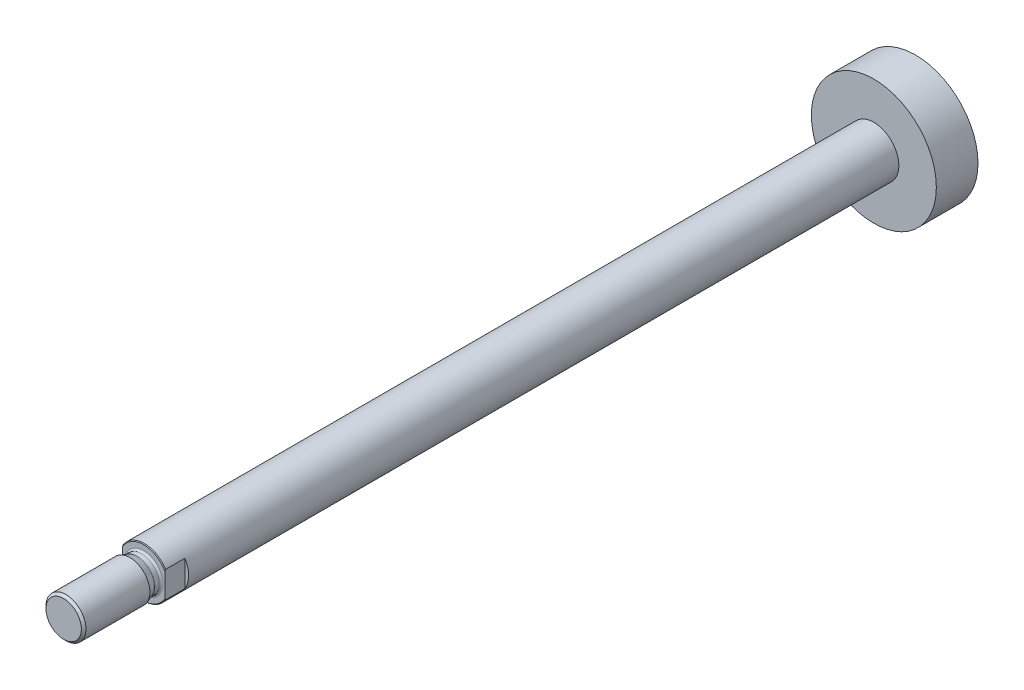
ISO-10303-21;
HEADER;
FILE_DESCRIPTION(('STEP AP214'),'2;1');
FILE_NAME('part.step','',(''),(''),'','','');
FILE_SCHEMA(('AUTOMOTIVE_DESIGN { 1 0 10303 214 1 1 1 1 }'));
ENDSEC;
DATA;
#1=APPLICATION_CONTEXT('core data for automotive mechanical design processes');
#2=APPLICATION_PROTOCOL_DEFINITION('international standard','automotive_design',2000,#1);
#3=PRODUCT_CONTEXT('',#1,'mechanical');
#4=PRODUCT('Part','Part','',(#3));
#5=PRODUCT_RELATED_PRODUCT_CATEGORY('part','',(#4));
#6=PRODUCT_DEFINITION_FORMATION('','',#4);
#7=PRODUCT_DEFINITION_CONTEXT('part definition',#1,'design');
#8=PRODUCT_DEFINITION('design','',#6,#7);
#9=PRODUCT_DEFINITION_SHAPE('','',#8);
#10=(LENGTH_UNIT() NAMED_UNIT(*) SI_UNIT(.MILLI.,.METRE.));
#11=(NAMED_UNIT(*) PLANE_ANGLE_UNIT() SI_UNIT($,.RADIAN.));
#12=(NAMED_UNIT(*) SI_UNIT($,.STERADIAN.) SOLID_ANGLE_UNIT());
#13=UNCERTAINTY_MEASURE_WITH_UNIT(LENGTH_MEASURE(1.E-05),#10,'distance_accuracy_value','');
#14=(GEOMETRIC_REPRESENTATION_CONTEXT(3) GLOBAL_UNCERTAINTY_ASSIGNED_CONTEXT((#13)) GLOBAL_UNIT_ASSIGNED_CONTEXT((#10,
#11,#12)) REPRESENTATION_CONTEXT('',''));
#15=CARTESIAN_POINT('',(0.,0.,0.));
#16=DIRECTION('',(0.,0.,1.));
#17=DIRECTION('',(1.,0.,0.));
#18=AXIS2_PLACEMENT_3D('',#15,#16,#17);
#19=CARTESIAN_POINT('',(0.,0.,35.517157287525));
#20=DIRECTION('',(0.,0.,-1.));
#21=DIRECTION('',(-1.,0.,0.));
#22=AXIS2_PLACEMENT_3D('',#19,#20,#21);
#23=CONICAL_SURFACE('',#22,10.,0.785398163396789);
#24=CARTESIAN_POINT('',(0.,0.,35.517157287525));
#25=DIRECTION('',(0.,0.,1.));
#26=DIRECTION('',(1.,0.,0.));
#27=AXIS2_PLACEMENT_3D('',#24,#25,#26);
#28=CIRCLE('',#27,10.);
#29=CARTESIAN_POINT('',(8.5,5.26782687642637,35.5171572875251));
#30=VERTEX_POINT('',#29);
#31=CARTESIAN_POINT('',(-8.5,5.26782687642637,35.517157287525));
#32=VERTEX_POINT('',#31);
#33=EDGE_CURVE('E111',#30,#32,#28,.T.);
#34=ORIENTED_EDGE('',*,*,#33,.T.);
#35=CARTESIAN_POINT('',(-8.5,5.26915557656065,35.516457287525));
#36=CARTESIAN_POINT('',(-8.5,5.12043060075285,35.5948084470723));
#37=CARTESIAN_POINT('',(-8.5,4.97072659120836,35.6712969898472));
#38=CARTESIAN_POINT('',(-8.5,4.66917700252257,35.8200459260869));
#39=CARTESIAN_POINT('',(-8.5,4.51733076749188,35.892304988137));
#40=CARTESIAN_POINT('',(-8.5,4.05732044553358,36.1024241503473));
#41=CARTESIAN_POINT('',(-8.5,3.74577535220427,36.233042707959));
#42=CARTESIAN_POINT('',(-8.5,3.11534351671797,36.4689248269962));
#43=CARTESIAN_POINT('',(-8.5,2.79651503376638,36.5743421856605));
#44=CARTESIAN_POINT('',(-8.5,2.1506721380425,36.7547567774749));
#45=CARTESIAN_POINT('',(-8.5,1.82367112190679,36.8298007197674));
#46=CARTESIAN_POINT('',(-8.5,1.24231953836921,36.9304202267378));
#47=CARTESIAN_POINT('',(-8.5,0.989271939120768,36.9635301629902));
#48=CARTESIAN_POINT('',(-8.5,0.481167069520872,37.0073090658038));
#49=CARTESIAN_POINT('',(-8.5,0.226109555666254,37.0179752699881));
#50=CARTESIAN_POINT('',(-8.5,-0.283937189922841,37.0162409520619));
#51=CARTESIAN_POINT('',(-8.5,-0.538926417990283,37.0038393722915));
#52=CARTESIAN_POINT('',(-8.5,-1.046754464396,36.9566828919383));
#53=CARTESIAN_POINT('',(-8.5,-1.29959352286743,36.9219305216357));
#54=CARTESIAN_POINT('',(-8.5,-1.87570958089529,36.8185336386205));
#55=CARTESIAN_POINT('',(-8.5,-2.19773337553153,36.7429103350757));
#56=CARTESIAN_POINT('',(-8.5,-2.83377743832144,36.5624420542977));
#57=CARTESIAN_POINT('',(-8.5,-3.14778540789577,36.457554811385));
#58=CARTESIAN_POINT('',(-8.5,-3.76859152936398,36.2236601146405));
#59=CARTESIAN_POINT('',(-8.5,-4.07533933724897,36.0945206165778));
#60=CARTESIAN_POINT('',(-8.5,-4.52839886908916,35.8870755616324));
#61=CARTESIAN_POINT('',(-8.5,-4.67798675824017,35.8157742380196));
#62=CARTESIAN_POINT('',(-8.5,-4.97508487478715,35.6690699624143));
#63=CARTESIAN_POINT('',(-8.5,-5.12259570663118,35.5936682360983));
#64=CARTESIAN_POINT('',(-8.5,-5.26915557656065,35.516457287525));
#65=B_SPLINE_CURVE_WITH_KNOTS('',3,(#35,#36,#37,#38,#39,#40,#41,#42,#43,#44,#45,#46,#47,#48,#49,
#50,#51,#52,#53,#54,#55,#56,#57,#58,#59,#60,#61,#62,#63,#64),.UNSPECIFIED.,.F.,.F.,(4,2,2,2,2,2,
2,2,2,2,2,2,2,2,4),(0.,0.504278327288993,1.00871455388979,2.02129192912044,3.02752230535171,
4.03219933682804,4.79690515443071,5.56170508659906,6.32654008577888,7.09128851504007,
8.08191982677642,9.07398937280026,10.0716257637772,10.5687120408264,11.0656505389054),.UNSPECIFIED.);
#66=CARTESIAN_POINT('',(-8.5,4.70883698491549,35.8));
#67=VERTEX_POINT('',#66);
#68=EDGE_CURVE('E123',#32,#67,#65,.T.);
#69=ORIENTED_EDGE('',*,*,#68,.T.);
#70=CARTESIAN_POINT('',(0.,0.,35.8));
#71=DIRECTION('',(0.,0.,1.));
#72=DIRECTION('',(1.,0.,0.));
#73=AXIS2_PLACEMENT_3D('',#70,#71,#72);
#74=CIRCLE('',#73,9.7171572875254);
#75=CARTESIAN_POINT('',(8.5,4.70883698491591,35.8));
#76=VERTEX_POINT('',#75);
#77=EDGE_CURVE('E97',#76,#67,#74,.T.);
#78=ORIENTED_EDGE('',*,*,#77,.F.);
#79=CARTESIAN_POINT('',(8.5,-5.26915557656065,35.516457287525));
#80=CARTESIAN_POINT('',(8.5,-5.12043060075285,35.5948084470723));
#81=CARTESIAN_POINT('',(8.5,-4.97072659120836,35.6712969898472));
#82=CARTESIAN_POINT('',(8.5,-4.66917700252257,35.8200459260869));
#83=CARTESIAN_POINT('',(8.5,-4.51733076749188,35.892304988137));
#84=CARTESIAN_POINT('',(8.5,-4.05732044553358,36.1024241503473));
#85=CARTESIAN_POINT('',(8.5,-3.74577535220427,36.233042707959));
#86=CARTESIAN_POINT('',(8.5,-3.11534351671797,36.4689248269962));
#87=CARTESIAN_POINT('',(8.5,-2.79651503376638,36.5743421856605));
#88=CARTESIAN_POINT('',(8.5,-2.1506721380425,36.7547567774749));
#89=CARTESIAN_POINT('',(8.5,-1.82367112190679,36.8298007197674));
#90=CARTESIAN_POINT('',(8.5,-1.24231953836921,36.9304202267378));
#91=CARTESIAN_POINT('',(8.5,-0.989271939120768,36.9635301629902));
#92=CARTESIAN_POINT('',(8.5,-0.481167069520872,37.0073090658038));
#93=CARTESIAN_POINT('',(8.5,-0.226109555666254,37.0179752699881));
#94=CARTESIAN_POINT('',(8.5,0.283937189922841,37.0162409520619));
#95=CARTESIAN_POINT('',(8.5,0.538926417990283,37.0038393722915));
#96=CARTESIAN_POINT('',(8.5,1.046754464396,36.9566828919383));
#97=CARTESIAN_POINT('',(8.5,1.29959352286743,36.9219305216357));
#98=CARTESIAN_POINT('',(8.5,1.87570958089529,36.8185336386205));
#99=CARTESIAN_POINT('',(8.5,2.19773337553153,36.7429103350757));
#100=CARTESIAN_POINT('',(8.5,2.83377743832144,36.5624420542977));
#101=CARTESIAN_POINT('',(8.5,3.14778540789577,36.457554811385));
#102=CARTESIAN_POINT('',(8.5,3.76859152936398,36.2236601146405));
#103=CARTESIAN_POINT('',(8.5,4.07533933724897,36.0945206165778));
#104=CARTESIAN_POINT('',(8.5,4.52839886908916,35.8870755616324));
#105=CARTESIAN_POINT('',(8.5,4.67798675824017,35.8157742380196));
#106=CARTESIAN_POINT('',(8.5,4.97508487478715,35.6690699624143));
#107=CARTESIAN_POINT('',(8.5,5.12259570663118,35.5936682360983));
#108=CARTESIAN_POINT('',(8.5,5.26915557656065,35.516457287525));
#109=B_SPLINE_CURVE_WITH_KNOTS('',3,(#79,#80,#81,#82,#83,#84,#85,#86,#87,#88,#89,#90,#91,#92,
#93,#94,#95,#96,#97,#98,#99,#100,#101,#102,#103,#104,#105,#106,#107,#108),.UNSPECIFIED.,.F.,.F.,
(4,2,2,2,2,2,2,2,2,2,2,2,2,2,4),(0.,0.504278327288993,1.00871455388979,2.02129192912044,
3.02752230535171,4.03219933682804,4.79690515443071,5.56170508659906,6.32654008577888,
7.09128851504007,8.08191982677642,9.07398937280026,10.0716257637772,10.5687120408264,
11.0656505389054),.UNSPECIFIED.);
#110=EDGE_CURVE('E125',#76,#30,#109,.T.);
#111=ORIENTED_EDGE('',*,*,#110,.T.);
#112=EDGE_LOOP('',(#34,#69,#78,#111));
#113=FACE_BOUND('',#112,.T.);
#114=ADVANCED_FACE('F40',(#113),#23,.T.);
#115=CARTESIAN_POINT('',(0.,0.,35.8));
#116=DIRECTION('',(0.,0.,-1.));
#117=DIRECTION('',(-1.,0.,0.));
#118=AXIS2_PLACEMENT_3D('',#115,#116,#117);
#119=PLANE('',#118);
#120=CARTESIAN_POINT('',(0.,0.,35.8));
#121=DIRECTION('',(0.,0.,1.));
#122=DIRECTION('',(1.,0.,0.));
#123=AXIS2_PLACEMENT_3D('',#120,#121,#122);
#124=CIRCLE('',#123,7.69999999999987);
#125=CARTESIAN_POINT('',(7.69999999999987,0.,35.8));
#126=VERTEX_POINT('',#125);
#127=EDGE_CURVE('E11',#126,#126,#124,.T.);
#128=ORIENTED_EDGE('',*,*,#127,.F.);
#129=EDGE_LOOP('',(#128));
#130=FACE_BOUND('',#129,.T.);
#131=ORIENTED_EDGE('',*,*,#77,.T.);
#132=DIRECTION('',(0.,-1.,0.));
#133=VECTOR('',#132,1.);
#134=CARTESIAN_POINT('',(-8.5,0.,35.8));
#135=LINE('',#134,#133);
#136=CARTESIAN_POINT('',(-8.5,-4.70883698491591,35.8));
#137=VERTEX_POINT('',#136);
#138=EDGE_CURVE('E137',#67,#137,#135,.T.);
#139=ORIENTED_EDGE('',*,*,#138,.T.);
#140=CARTESIAN_POINT('',(8.5,-4.70883698491549,35.8));
#141=VERTEX_POINT('',#140);
#142=EDGE_CURVE('E126',#137,#141,#74,.T.);
#143=ORIENTED_EDGE('',*,*,#142,.T.);
#144=DIRECTION('',(0.,1.,0.));
#145=VECTOR('',#144,1.);
#146=CARTESIAN_POINT('',(8.5,0.,35.8));
#147=LINE('',#146,#145);
#148=EDGE_CURVE('E139',#141,#76,#147,.T.);
#149=ORIENTED_EDGE('',*,*,#148,.T.);
#150=EDGE_LOOP('',(#131,#139,#143,#149));
#151=FACE_BOUND('',#150,.T.);
#152=ADVANCED_FACE('F42',(#130,#151),#119,.F.);
#153=ORIENTED_EDGE('',*,*,#142,.F.);
#154=CARTESIAN_POINT('',(-8.5,-5.26782687642637,35.5171572875251));
#155=VERTEX_POINT('',#154);
#156=EDGE_CURVE('E143',#137,#155,#65,.T.);
#157=ORIENTED_EDGE('',*,*,#156,.T.);
#158=CARTESIAN_POINT('',(8.5,-5.26782687642637,35.517157287525));
#159=VERTEX_POINT('',#158);
#160=EDGE_CURVE('E127',#155,#159,#28,.T.);
#161=ORIENTED_EDGE('',*,*,#160,.T.);
#162=EDGE_CURVE('E141',#159,#141,#109,.T.);
#163=ORIENTED_EDGE('',*,*,#162,.T.);
#164=EDGE_LOOP('',(#153,#157,#161,#163));
#165=FACE_BOUND('',#164,.T.);
#166=ADVANCED_FACE('F159',(#165),#23,.T.);
#167=CARTESIAN_POINT('',(0.,0.,-273.));
#168=DIRECTION('',(0.,0.,1.));
#169=DIRECTION('',(1.,0.,0.));
#170=AXIS2_PLACEMENT_3D('',#167,#168,#169);
#171=CYLINDRICAL_SURFACE('',#170,10.);
#172=CARTESIAN_POINT('',(0.,0.,27.8));
#173=DIRECTION('',(0.,0.,-1.));
#174=DIRECTION('',(-1.,0.,0.));
#175=AXIS2_PLACEMENT_3D('',#172,#173,#174);
#176=CIRCLE('',#175,10.);
#177=CARTESIAN_POINT('',(-8.5,-5.26782687642637,27.8));
#178=VERTEX_POINT('',#177);
#179=CARTESIAN_POINT('',(-8.5,5.26782687642637,27.8));
#180=VERTEX_POINT('',#179);
#181=EDGE_CURVE('E119',#178,#180,#176,.T.);
#182=ORIENTED_EDGE('',*,*,#181,.T.);
#183=DIRECTION('',(0.,0.,1.));
#184=VECTOR('',#183,1.);
#185=CARTESIAN_POINT('',(-8.5,5.26782687642637,-273.));
#186=LINE('',#185,#184);
#187=EDGE_CURVE('E48',#180,#32,#186,.T.);
#188=ORIENTED_EDGE('',*,*,#187,.T.);
#189=ORIENTED_EDGE('',*,*,#33,.F.);
#190=DIRECTION('',(0.,0.,1.));
#191=VECTOR('',#190,1.);
#192=CARTESIAN_POINT('',(8.5,5.26782687642637,-273.));
#193=LINE('',#192,#191);
#194=CARTESIAN_POINT('',(8.5,5.26782687642637,27.8));
#195=VERTEX_POINT('',#194);
#196=EDGE_CURVE('E96',#30,#195,#193,.F.);
#197=ORIENTED_EDGE('',*,*,#196,.T.);
#198=CARTESIAN_POINT('',(0.,0.,27.8));
#199=DIRECTION('',(0.,0.,-1.));
#200=DIRECTION('',(-1.,0.,0.));
#201=AXIS2_PLACEMENT_3D('',#198,#199,#200);
#202=CIRCLE('',#201,10.);
#203=CARTESIAN_POINT('',(8.5,-5.26782687642637,27.8));
#204=VERTEX_POINT('',#203);
#205=EDGE_CURVE('E91',#195,#204,#202,.T.);
#206=ORIENTED_EDGE('',*,*,#205,.T.);
#207=DIRECTION('',(0.,0.,1.));
#208=VECTOR('',#207,1.);
#209=CARTESIAN_POINT('',(8.5,-5.26782687642637,-273.));
#210=LINE('',#209,#208);
#211=EDGE_CURVE('E102',#204,#159,#210,.T.);
#212=ORIENTED_EDGE('',*,*,#211,.T.);
#213=ORIENTED_EDGE('',*,*,#160,.F.);
#214=DIRECTION('',(0.,0.,1.));
#215=VECTOR('',#214,1.);
#216=CARTESIAN_POINT('',(-8.5,-5.26782687642637,-273.));
#217=LINE('',#216,#215);
#218=EDGE_CURVE('E113',#155,#178,#217,.F.);
#219=ORIENTED_EDGE('',*,*,#218,.T.);
#220=EDGE_LOOP('',(#182,#188,#189,#197,#206,#212,#213,#219));
#221=FACE_BOUND('',#220,.T.);
#222=CARTESIAN_POINT('',(0.,0.,-256.33333333333));
#223=DIRECTION('',(0.,0.,1.));
#224=DIRECTION('',(1.,0.,0.));
#225=AXIS2_PLACEMENT_3D('',#222,#223,#224);
#226=CIRCLE('',#225,10.);
#227=CARTESIAN_POINT('',(10.,0.,-256.33333333333));
#228=VERTEX_POINT('',#227);
#229=EDGE_CURVE('E131',#228,#228,#226,.T.);
#230=ORIENTED_EDGE('',*,*,#229,.T.);
#231=EDGE_LOOP('',(#230));
#232=FACE_BOUND('',#231,.T.);
#233=ADVANCED_FACE('F107',(#221,#232),#171,.T.);
#234=CARTESIAN_POINT('',(0.,10.,-256.33333333333));
#235=DIRECTION('',(0.,0.,-1.));
#236=DIRECTION('',(-1.,0.,0.));
#237=AXIS2_PLACEMENT_3D('',#234,#235,#236);
#238=PLANE('',#237);
#239=ORIENTED_EDGE('',*,*,#229,.F.);
#240=EDGE_LOOP('',(#239));
#241=FACE_BOUND('',#240,.T.);
#242=CARTESIAN_POINT('',(0.,0.,-256.33333333333));
#243=DIRECTION('',(0.,0.,1.));
#244=DIRECTION('',(1.,0.,0.));
#245=AXIS2_PLACEMENT_3D('',#242,#243,#244);
#246=CIRCLE('',#245,25.);
#247=CARTESIAN_POINT('',(25.,0.,-256.33333333333));
#248=VERTEX_POINT('',#247);
#249=EDGE_CURVE('E253',#248,#248,#246,.T.);
#250=ORIENTED_EDGE('',*,*,#249,.T.);
#251=EDGE_LOOP('',(#250));
#252=FACE_BOUND('',#251,.T.);
#253=ADVANCED_FACE('F181',(#241,#252),#238,.F.);
#254=CARTESIAN_POINT('',(0.,0.,-273.));
#255=DIRECTION('',(0.,0.,1.));
#256=DIRECTION('',(1.,0.,0.));
#257=AXIS2_PLACEMENT_3D('',#254,#255,#256);
#258=CYLINDRICAL_SURFACE('',#257,25.);
#259=ORIENTED_EDGE('',*,*,#249,.F.);
#260=EDGE_LOOP('',(#259));
#261=FACE_BOUND('',#260,.T.);
#262=CARTESIAN_POINT('',(0.,0.,-273.));
#263=DIRECTION('',(0.,0.,1.));
#264=DIRECTION('',(1.,0.,0.));
#265=AXIS2_PLACEMENT_3D('',#262,#263,#264);
#266=CIRCLE('',#265,25.);
#267=CARTESIAN_POINT('',(25.,0.,-273.));
#268=VERTEX_POINT('',#267);
#269=EDGE_CURVE('E251',#268,#268,#266,.T.);
#270=ORIENTED_EDGE('',*,*,#269,.T.);
#271=EDGE_LOOP('',(#270));
#272=FACE_BOUND('',#271,.T.);
#273=ADVANCED_FACE('F177',(#261,#272),#258,.T.);
#274=CARTESIAN_POINT('',(0.,25.,-273.));
#275=DIRECTION('',(0.,0.,1.));
#276=DIRECTION('',(1.,0.,0.));
#277=AXIS2_PLACEMENT_3D('',#274,#275,#276);
#278=PLANE('',#277);
#279=ORIENTED_EDGE('',*,*,#269,.F.);
#280=EDGE_LOOP('',(#279));
#281=FACE_BOUND('',#280,.T.);
#282=ADVANCED_FACE('F174',(#281),#278,.F.);
#283=CARTESIAN_POINT('',(17.,-17.,27.8));
#284=DIRECTION('',(0.,0.,-1.));
#285=DIRECTION('',(-1.,0.,0.));
#286=AXIS2_PLACEMENT_3D('',#283,#284,#285);
#287=PLANE('',#286);
#288=DIRECTION('',(0.,1.,0.));
#289=VECTOR('',#288,1.);
#290=CARTESIAN_POINT('',(8.5,-17.,27.8));
#291=LINE('',#290,#289);
#292=EDGE_CURVE('E62',#204,#195,#291,.T.);
#293=ORIENTED_EDGE('',*,*,#292,.F.);
#294=ORIENTED_EDGE('',*,*,#205,.F.);
#295=EDGE_LOOP('',(#293,#294));
#296=FACE_BOUND('',#295,.T.);
#297=ADVANCED_FACE('F92',(#296),#287,.F.);
#298=CARTESIAN_POINT('',(8.5,-17.,27.8));
#299=DIRECTION('',(-1.,0.,0.));
#300=DIRECTION('',(0.,0.,1.));
#301=AXIS2_PLACEMENT_3D('',#298,#299,#300);
#302=PLANE('',#301);
#303=ORIENTED_EDGE('',*,*,#292,.T.);
#304=ORIENTED_EDGE('',*,*,#196,.F.);
#305=ORIENTED_EDGE('',*,*,#110,.F.);
#306=ORIENTED_EDGE('',*,*,#148,.F.);
#307=ORIENTED_EDGE('',*,*,#162,.F.);
#308=ORIENTED_EDGE('',*,*,#211,.F.);
#309=EDGE_LOOP('',(#303,#304,#305,#306,#307,#308));
#310=FACE_BOUND('',#309,.T.);
#311=ADVANCED_FACE('F100',(#310),#302,.F.);
#312=CARTESIAN_POINT('',(-8.5,-17.,27.8));
#313=DIRECTION('',(0.,0.,-1.));
#314=DIRECTION('',(-1.,0.,0.));
#315=AXIS2_PLACEMENT_3D('',#312,#313,#314);
#316=PLANE('',#315);
#317=DIRECTION('',(0.,1.,0.));
#318=VECTOR('',#317,1.);
#319=CARTESIAN_POINT('',(-8.5,-17.,27.8));
#320=LINE('',#319,#318);
#321=EDGE_CURVE('E55',#178,#180,#320,.T.);
#322=ORIENTED_EDGE('',*,*,#321,.T.);
#323=ORIENTED_EDGE('',*,*,#181,.F.);
#324=EDGE_LOOP('',(#322,#323));
#325=FACE_BOUND('',#324,.T.);
#326=ADVANCED_FACE('F167',(#325),#316,.F.);
#327=CARTESIAN_POINT('',(-8.5,-17.,43.8));
#328=DIRECTION('',(1.,0.,0.));
#329=DIRECTION('',(0.,0.,-1.));
#330=AXIS2_PLACEMENT_3D('',#327,#328,#329);
#331=PLANE('',#330);
#332=ORIENTED_EDGE('',*,*,#321,.F.);
#333=ORIENTED_EDGE('',*,*,#218,.F.);
#334=ORIENTED_EDGE('',*,*,#156,.F.);
#335=ORIENTED_EDGE('',*,*,#138,.F.);
#336=ORIENTED_EDGE('',*,*,#68,.F.);
#337=ORIENTED_EDGE('',*,*,#187,.F.);
#338=EDGE_LOOP('',(#332,#333,#334,#335,#336,#337));
#339=FACE_BOUND('',#338,.T.);
#340=ADVANCED_FACE('F162',(#339),#331,.F.);
#341=CARTESIAN_POINT('',(0.,0.,36.5499999999999));
#342=DIRECTION('',(0.,0.,1.));
#343=DIRECTION('',(1.,0.,0.));
#344=AXIS2_PLACEMENT_3D('',#341,#342,#343);
#345=TOROIDAL_SURFACE('',#344,7.69999999999987,0.749999999999868);
#346=CARTESIAN_POINT('',(0.,0.,36.55));
#347=DIRECTION('',(0.,0.,1.));
#348=DIRECTION('',(1.,0.,0.));
#349=AXIS2_PLACEMENT_3D('',#346,#347,#348);
#350=CIRCLE('',#349,6.95);
#351=CARTESIAN_POINT('',(6.95,0.,36.55));
#352=VERTEX_POINT('',#351);
#353=EDGE_CURVE('E103',#352,#352,#350,.T.);
#354=ORIENTED_EDGE('',*,*,#353,.F.);
#355=EDGE_LOOP('',(#354));
#356=FACE_BOUND('',#355,.T.);
#357=ORIENTED_EDGE('',*,*,#127,.T.);
#358=EDGE_LOOP('',(#357));
#359=FACE_BOUND('',#358,.T.);
#360=ADVANCED_FACE('F166',(#356,#359),#345,.F.);
#361=CARTESIAN_POINT('',(0.,0.,35.05));
#362=DIRECTION('',(0.,0.,1.));
#363=DIRECTION('',(1.,0.,0.));
#364=AXIS2_PLACEMENT_3D('',#361,#362,#363);
#365=CYLINDRICAL_SURFACE('',#364,6.95);
#366=CARTESIAN_POINT('',(0.,0.,38.267754764469));
#367=DIRECTION('',(0.,0.,1.));
#368=DIRECTION('',(1.,0.,0.));
#369=AXIS2_PLACEMENT_3D('',#366,#367,#368);
#370=CIRCLE('',#369,6.95);
#371=CARTESIAN_POINT('',(6.95,0.,38.267754764469));
#372=VERTEX_POINT('',#371);
#373=EDGE_CURVE('E244',#372,#372,#370,.T.);
#374=ORIENTED_EDGE('',*,*,#373,.F.);
#375=EDGE_LOOP('',(#374));
#376=FACE_BOUND('',#375,.T.);
#377=ORIENTED_EDGE('',*,*,#353,.T.);
#378=EDGE_LOOP('',(#377));
#379=FACE_BOUND('',#378,.T.);
#380=ADVANCED_FACE('F200',(#376,#379),#365,.T.);
#381=CARTESIAN_POINT('',(0.,0.,38.2677547644694));
#382=DIRECTION('',(0.,0.,1.));
#383=DIRECTION('',(1.,0.,0.));
#384=AXIS2_PLACEMENT_3D('',#381,#382,#383);
#385=TOROIDAL_SURFACE('',#384,7.69999999999571,0.74999999999571);
#386=CARTESIAN_POINT('',(0.,0.,38.5242698719622));
#387=DIRECTION('',(0.,0.,1.));
#388=DIRECTION('',(1.,0.,0.));
#389=AXIS2_PLACEMENT_3D('',#386,#387,#388);
#390=CIRCLE('',#389,6.99523053441032);
#391=CARTESIAN_POINT('',(6.99523053441032,0.,38.5242698719622));
#392=VERTEX_POINT('',#391);
#393=EDGE_CURVE('E241',#392,#392,#390,.T.);
#394=ORIENTED_EDGE('',*,*,#393,.F.);
#395=EDGE_LOOP('',(#394));
#396=FACE_BOUND('',#395,.T.);
#397=ORIENTED_EDGE('',*,*,#373,.T.);
#398=EDGE_LOOP('',(#397));
#399=FACE_BOUND('',#398,.T.);
#400=ADVANCED_FACE('F205',(#396,#399),#385,.F.);
#401=CARTESIAN_POINT('',(0.,0.,38.5242698719622));
#402=DIRECTION('',(0.,0.,1.));
#403=DIRECTION('',(1.,0.,0.));
#404=AXIS2_PLACEMENT_3D('',#401,#402,#403);
#405=CONICAL_SURFACE('',#404,6.99523053441032,0.349065850398908);
#406=CARTESIAN_POINT('',(0.,0.,41.284851290427));
#407=DIRECTION('',(0.,0.,1.));
#408=DIRECTION('',(1.,0.,0.));
#409=AXIS2_PLACEMENT_3D('',#406,#407,#408);
#410=CIRCLE('',#409,8.);
#411=CARTESIAN_POINT('',(8.,0.,41.284851290427));
#412=VERTEX_POINT('',#411);
#413=EDGE_CURVE('E236',#412,#412,#410,.T.);
#414=ORIENTED_EDGE('',*,*,#413,.F.);
#415=EDGE_LOOP('',(#414));
#416=FACE_BOUND('',#415,.T.);
#417=ORIENTED_EDGE('',*,*,#393,.T.);
#418=EDGE_LOOP('',(#417));
#419=FACE_BOUND('',#418,.T.);
#420=ADVANCED_FACE('F212',(#416,#419),#405,.T.);
#421=CARTESIAN_POINT('',(0.,0.,35.05));
#422=DIRECTION('',(0.,0.,1.));
#423=DIRECTION('',(1.,0.,0.));
#424=AXIS2_PLACEMENT_3D('',#421,#422,#423);
#425=CYLINDRICAL_SURFACE('',#424,8.);
#426=CARTESIAN_POINT('',(0.,0.,66.88));
#427=DIRECTION('',(0.,0.,1.));
#428=DIRECTION('',(1.,0.,0.));
#429=AXIS2_PLACEMENT_3D('',#426,#427,#428);
#430=CIRCLE('',#429,8.);
#431=CARTESIAN_POINT('',(8.,0.,66.88));
#432=VERTEX_POINT('',#431);
#433=EDGE_CURVE('E233',#432,#432,#430,.T.);
#434=ORIENTED_EDGE('',*,*,#433,.F.);
#435=EDGE_LOOP('',(#434));
#436=FACE_BOUND('',#435,.T.);
#437=ORIENTED_EDGE('',*,*,#413,.T.);
#438=EDGE_LOOP('',(#437));
#439=FACE_BOUND('',#438,.T.);
#440=ADVANCED_FACE('F216',(#436,#439),#425,.T.);
#441=CARTESIAN_POINT('',(0.,0.,66.88));
#442=DIRECTION('',(0.,0.,-1.));
#443=DIRECTION('',(-1.,0.,0.));
#444=AXIS2_PLACEMENT_3D('',#441,#442,#443);
#445=CONICAL_SURFACE('',#444,8.,0.785398163397446);
#446=CARTESIAN_POINT('',(0.,0.,67.8));
#447=DIRECTION('',(0.,0.,1.));
#448=DIRECTION('',(1.,0.,0.));
#449=AXIS2_PLACEMENT_3D('',#446,#447,#448);
#450=CIRCLE('',#449,7.08);
#451=CARTESIAN_POINT('',(7.08,0.,67.8));
#452=VERTEX_POINT('',#451);
#453=EDGE_CURVE('E232',#452,#452,#450,.T.);
#454=ORIENTED_EDGE('',*,*,#453,.F.);
#455=EDGE_LOOP('',(#454));
#456=FACE_BOUND('',#455,.T.);
#457=ORIENTED_EDGE('',*,*,#433,.T.);
#458=EDGE_LOOP('',(#457));
#459=FACE_BOUND('',#458,.T.);
#460=ADVANCED_FACE('F220',(#456,#459),#445,.T.);
#461=CARTESIAN_POINT('',(0.,0.,67.8));
#462=DIRECTION('',(0.,0.,-1.));
#463=DIRECTION('',(-1.,0.,0.));
#464=AXIS2_PLACEMENT_3D('',#461,#462,#463);
#465=PLANE('',#464);
#466=ORIENTED_EDGE('',*,*,#453,.T.);
#467=EDGE_LOOP('',(#466));
#468=FACE_BOUND('',#467,.T.);
#469=ADVANCED_FACE('F224',(#468),#465,.F.);
#470=CLOSED_SHELL('',(#114,#152,#166,#233,#253,#273,#282,#297,#311,#326,#340,#360,#380,#400,
#420,#440,#460,#469));
#471=MANIFOLD_SOLID_BREP('B2',#470);
#472=ADVANCED_BREP_SHAPE_REPRESENTATION('',(#18,#471),#14);
#473=SHAPE_DEFINITION_REPRESENTATION(#9,#472);
ENDSEC;
END-ISO-10303-21;
